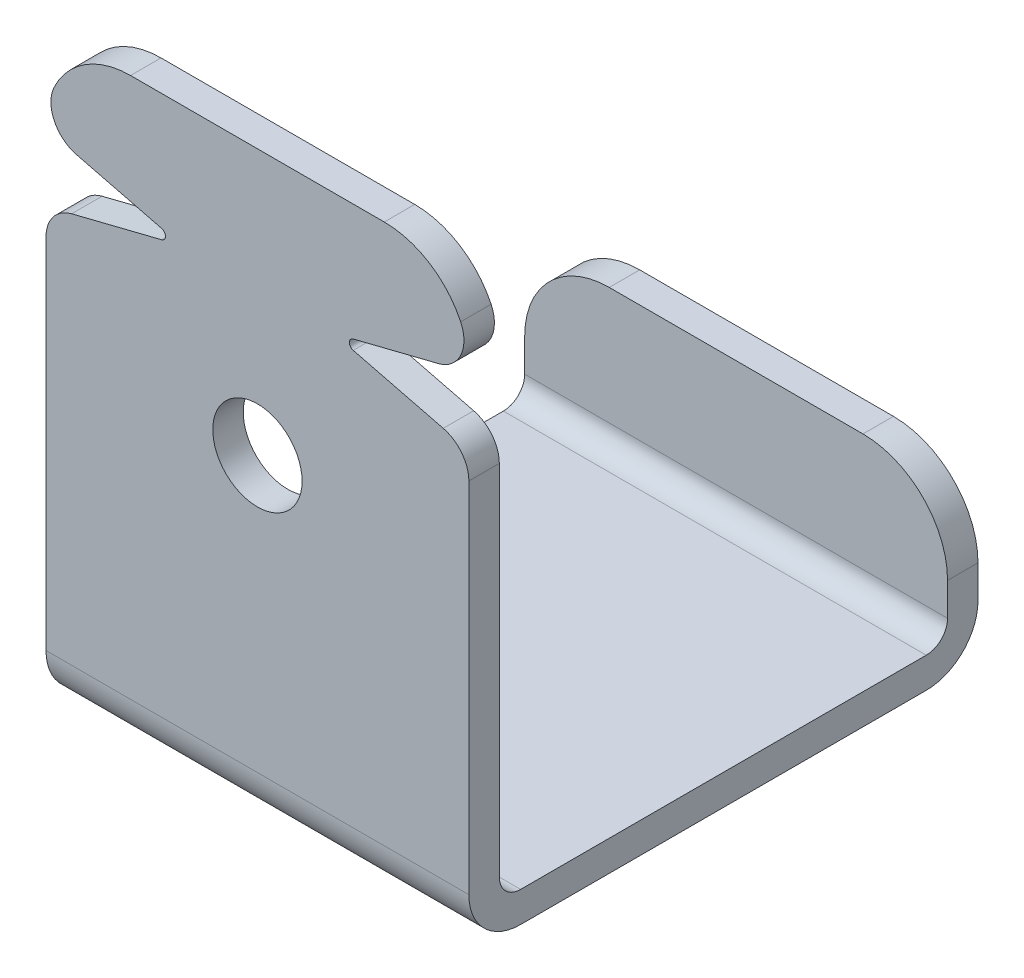
ISO-10303-21;
HEADER;
FILE_DESCRIPTION(('STEP AP214'),'2;1');
FILE_NAME('part.step','',(''),(''),'','','');
FILE_SCHEMA(('AUTOMOTIVE_DESIGN { 1 0 10303 214 1 1 1 1 }'));
ENDSEC;
DATA;
#1=APPLICATION_CONTEXT('core data for automotive mechanical design processes');
#2=APPLICATION_PROTOCOL_DEFINITION('international standard','automotive_design',2000,#1);
#3=PRODUCT_CONTEXT('',#1,'mechanical');
#4=PRODUCT('Part','Part','',(#3));
#5=PRODUCT_RELATED_PRODUCT_CATEGORY('part','',(#4));
#6=PRODUCT_DEFINITION_FORMATION('','',#4);
#7=PRODUCT_DEFINITION_CONTEXT('part definition',#1,'design');
#8=PRODUCT_DEFINITION('design','',#6,#7);
#9=PRODUCT_DEFINITION_SHAPE('','',#8);
#10=(LENGTH_UNIT() NAMED_UNIT(*) SI_UNIT(.MILLI.,.METRE.));
#11=(NAMED_UNIT(*) PLANE_ANGLE_UNIT() SI_UNIT($,.RADIAN.));
#12=(NAMED_UNIT(*) SI_UNIT($,.STERADIAN.) SOLID_ANGLE_UNIT());
#13=UNCERTAINTY_MEASURE_WITH_UNIT(LENGTH_MEASURE(1.E-05),#10,'distance_accuracy_value','');
#14=(GEOMETRIC_REPRESENTATION_CONTEXT(3) GLOBAL_UNCERTAINTY_ASSIGNED_CONTEXT((#13)) GLOBAL_UNIT_ASSIGNED_CONTEXT((#10,
#11,#12)) REPRESENTATION_CONTEXT('',''));
#15=CARTESIAN_POINT('',(0.,0.,0.));
#16=DIRECTION('',(0.,0.,1.));
#17=DIRECTION('',(1.,0.,0.));
#18=AXIS2_PLACEMENT_3D('',#15,#16,#17);
#19=CARTESIAN_POINT('',(15.875,0.,-16.8275));
#20=DIRECTION('',(0.,0.,1.));
#21=DIRECTION('',(0.,-1.,0.));
#22=AXIS2_PLACEMENT_3D('',#19,#20,#21);
#23=PLANE('',#22);
#24=DIRECTION('',(0.,1.,0.));
#25=VECTOR('',#24,1.);
#26=CARTESIAN_POINT('',(15.875,0.,-16.8275));
#27=LINE('',#26,#25);
#28=CARTESIAN_POINT('',(15.875,6.35,-16.8275));
#29=VERTEX_POINT('',#28);
#30=CARTESIAN_POINT('',(15.875,3.8862,-16.8275));
#31=VERTEX_POINT('',#30);
#32=EDGE_CURVE('E199',#29,#31,#27,.F.);
#33=ORIENTED_EDGE('',*,*,#32,.F.);
#34=CARTESIAN_POINT('',(9.525,6.35,-16.8275));
#35=DIRECTION('',(0.,0.,-1.));
#36=DIRECTION('',(0.,1.,0.));
#37=AXIS2_PLACEMENT_3D('',#34,#35,#36);
#38=CIRCLE('',#37,6.35);
#39=CARTESIAN_POINT('',(9.525,12.7,-16.8275));
#40=VERTEX_POINT('',#39);
#41=EDGE_CURVE('E20',#40,#29,#38,.T.);
#42=ORIENTED_EDGE('',*,*,#41,.F.);
#43=DIRECTION('',(1.,0.,0.));
#44=VECTOR('',#43,1.);
#45=CARTESIAN_POINT('',(15.875,12.7,-16.8275));
#46=LINE('',#45,#44);
#47=CARTESIAN_POINT('',(-9.525,12.7,-16.8275));
#48=VERTEX_POINT('',#47);
#49=EDGE_CURVE('E186',#48,#40,#46,.T.);
#50=ORIENTED_EDGE('',*,*,#49,.F.);
#51=CARTESIAN_POINT('',(-9.525,6.35,-16.8275));
#52=DIRECTION('',(0.,0.,1.));
#53=DIRECTION('',(0.,-1.,0.));
#54=AXIS2_PLACEMENT_3D('',#51,#52,#53);
#55=CIRCLE('',#54,6.35);
#56=CARTESIAN_POINT('',(-15.875,6.35,-16.8275));
#57=VERTEX_POINT('',#56);
#58=EDGE_CURVE('E310',#57,#48,#55,.F.);
#59=ORIENTED_EDGE('',*,*,#58,.F.);
#60=DIRECTION('',(0.,1.,0.));
#61=VECTOR('',#60,1.);
#62=CARTESIAN_POINT('',(-15.875,0.,-16.8275));
#63=LINE('',#62,#61);
#64=CARTESIAN_POINT('',(-15.875,3.8862,-16.8275));
#65=VERTEX_POINT('',#64);
#66=EDGE_CURVE('E331',#57,#65,#63,.F.);
#67=ORIENTED_EDGE('',*,*,#66,.T.);
#68=DIRECTION('',(-1.,0.,0.));
#69=VECTOR('',#68,1.);
#70=CARTESIAN_POINT('',(15.875,3.8862,-16.8275));
#71=LINE('',#70,#69);
#72=EDGE_CURVE('E202',#65,#31,#71,.F.);
#73=ORIENTED_EDGE('',*,*,#72,.T.);
#74=EDGE_LOOP('',(#33,#42,#50,#59,#67,#73));
#75=FACE_BOUND('',#74,.T.);
#76=ADVANCED_FACE('F17',(#75),#23,.T.);
#77=CARTESIAN_POINT('',(9.525,6.34999999999999,-19.1135));
#78=DIRECTION('',(0.,0.,-1.));
#79=DIRECTION('',(0.,1.,0.));
#80=AXIS2_PLACEMENT_3D('',#77,#78,#79);
#81=CYLINDRICAL_SURFACE('',#80,6.35);
#82=CARTESIAN_POINT('',(9.525,6.34999999999999,-19.1135));
#83=DIRECTION('',(0.,0.,-1.));
#84=DIRECTION('',(0.,1.,0.));
#85=AXIS2_PLACEMENT_3D('',#82,#83,#84);
#86=CIRCLE('',#85,6.35);
#87=CARTESIAN_POINT('',(15.875,6.34999999999999,-19.1135));
#88=VERTEX_POINT('',#87);
#89=CARTESIAN_POINT('',(9.525,12.7,-19.1135));
#90=VERTEX_POINT('',#89);
#91=EDGE_CURVE('E307',#88,#90,#86,.F.);
#92=ORIENTED_EDGE('',*,*,#91,.T.);
#93=DIRECTION('',(0.,0.,1.));
#94=VECTOR('',#93,1.);
#95=CARTESIAN_POINT('',(9.525,12.7,-19.1135));
#96=LINE('',#95,#94);
#97=EDGE_CURVE('E197',#40,#90,#96,.F.);
#98=ORIENTED_EDGE('',*,*,#97,.F.);
#99=ORIENTED_EDGE('',*,*,#41,.T.);
#100=DIRECTION('',(0.,0.,-1.));
#101=VECTOR('',#100,1.);
#102=CARTESIAN_POINT('',(15.875,6.34999999999999,-19.1135));
#103=LINE('',#102,#101);
#104=EDGE_CURVE('E195',#29,#88,#103,.T.);
#105=ORIENTED_EDGE('',*,*,#104,.T.);
#106=EDGE_LOOP('',(#92,#98,#99,#105));
#107=FACE_BOUND('',#106,.T.);
#108=ADVANCED_FACE('F193',(#107),#81,.T.);
#109=CARTESIAN_POINT('',(15.875,12.7,-19.1135));
#110=DIRECTION('',(0.,1.,0.));
#111=DIRECTION('',(0.,0.,1.));
#112=AXIS2_PLACEMENT_3D('',#109,#110,#111);
#113=PLANE('',#112);
#114=ORIENTED_EDGE('',*,*,#49,.T.);
#115=ORIENTED_EDGE('',*,*,#97,.T.);
#116=DIRECTION('',(1.,0.,0.));
#117=VECTOR('',#116,1.);
#118=CARTESIAN_POINT('',(15.875,12.7,-19.1135));
#119=LINE('',#118,#117);
#120=CARTESIAN_POINT('',(-9.525,12.7,-19.1135));
#121=VERTEX_POINT('',#120);
#122=EDGE_CURVE('E306',#90,#121,#119,.F.);
#123=ORIENTED_EDGE('',*,*,#122,.T.);
#124=DIRECTION('',(0.,0.,1.));
#125=VECTOR('',#124,1.);
#126=CARTESIAN_POINT('',(-9.525,12.7,-19.1135));
#127=LINE('',#126,#125);
#128=EDGE_CURVE('E311',#48,#121,#127,.F.);
#129=ORIENTED_EDGE('',*,*,#128,.F.);
#130=EDGE_LOOP('',(#114,#115,#123,#129));
#131=FACE_BOUND('',#130,.T.);
#132=ADVANCED_FACE('F317',(#131),#113,.T.);
#133=CARTESIAN_POINT('',(-9.525,6.34999999999999,-19.1135));
#134=DIRECTION('',(0.,0.,1.));
#135=DIRECTION('',(0.,-1.,0.));
#136=AXIS2_PLACEMENT_3D('',#133,#134,#135);
#137=CYLINDRICAL_SURFACE('',#136,6.35);
#138=CARTESIAN_POINT('',(-9.525,6.34999999999999,-19.1135));
#139=DIRECTION('',(0.,0.,1.));
#140=DIRECTION('',(0.,-1.,0.));
#141=AXIS2_PLACEMENT_3D('',#138,#139,#140);
#142=CIRCLE('',#141,6.35);
#143=CARTESIAN_POINT('',(-15.875,6.34999999999999,-19.1135));
#144=VERTEX_POINT('',#143);
#145=EDGE_CURVE('E303',#121,#144,#142,.T.);
#146=ORIENTED_EDGE('',*,*,#145,.T.);
#147=DIRECTION('',(0.,0.,-1.));
#148=VECTOR('',#147,1.);
#149=CARTESIAN_POINT('',(-15.875,6.34999999999999,-19.1135));
#150=LINE('',#149,#148);
#151=EDGE_CURVE('E314',#144,#57,#150,.F.);
#152=ORIENTED_EDGE('',*,*,#151,.T.);
#153=ORIENTED_EDGE('',*,*,#58,.T.);
#154=ORIENTED_EDGE('',*,*,#128,.T.);
#155=EDGE_LOOP('',(#146,#152,#153,#154));
#156=FACE_BOUND('',#155,.T.);
#157=ADVANCED_FACE('F333',(#156),#137,.T.);
#158=CARTESIAN_POINT('',(15.875,3.8862,-15.2273));
#159=DIRECTION('',(-1.,0.,0.));
#160=DIRECTION('',(0.,0.,1.));
#161=AXIS2_PLACEMENT_3D('',#158,#159,#160);
#162=CYLINDRICAL_SURFACE('',#161,1.6002);
#163=ORIENTED_EDGE('',*,*,#72,.F.);
#164=CARTESIAN_POINT('',(-15.875,3.8862,-15.2273));
#165=DIRECTION('',(-1.,0.,0.));
#166=DIRECTION('',(0.,0.,1.));
#167=AXIS2_PLACEMENT_3D('',#164,#165,#166);
#168=CIRCLE('',#167,1.6002);
#169=CARTESIAN_POINT('',(-15.875,2.286,-15.2273));
#170=VERTEX_POINT('',#169);
#171=EDGE_CURVE('E298',#65,#170,#168,.T.);
#172=ORIENTED_EDGE('',*,*,#171,.T.);
#173=DIRECTION('',(1.,0.,0.));
#174=VECTOR('',#173,1.);
#175=CARTESIAN_POINT('',(15.875,2.286,-15.2273));
#176=LINE('',#175,#174);
#177=CARTESIAN_POINT('',(15.875,2.286,-15.2273));
#178=VERTEX_POINT('',#177);
#179=EDGE_CURVE('E301',#178,#170,#176,.F.);
#180=ORIENTED_EDGE('',*,*,#179,.F.);
#181=CARTESIAN_POINT('',(15.875,3.8862,-15.2273));
#182=DIRECTION('',(-1.,0.,0.));
#183=DIRECTION('',(0.,0.,1.));
#184=AXIS2_PLACEMENT_3D('',#181,#182,#183);
#185=CIRCLE('',#184,1.6002);
#186=EDGE_CURVE('E309',#178,#31,#185,.F.);
#187=ORIENTED_EDGE('',*,*,#186,.T.);
#188=EDGE_LOOP('',(#163,#172,#180,#187));
#189=FACE_BOUND('',#188,.T.);
#190=ADVANCED_FACE('F371',(#189),#162,.F.);
#191=CARTESIAN_POINT('',(15.875,0.,-19.1135));
#192=DIRECTION('',(0.,0.,1.));
#193=DIRECTION('',(0.,-1.,0.));
#194=AXIS2_PLACEMENT_3D('',#191,#192,#193);
#195=PLANE('',#194);
#196=ORIENTED_EDGE('',*,*,#145,.F.);
#197=ORIENTED_EDGE('',*,*,#122,.F.);
#198=ORIENTED_EDGE('',*,*,#91,.F.);
#199=DIRECTION('',(0.,-1.,0.));
#200=VECTOR('',#199,1.);
#201=CARTESIAN_POINT('',(15.875,0.,-19.1135));
#202=LINE('',#201,#200);
#203=CARTESIAN_POINT('',(15.875,3.8862,-19.1135));
#204=VERTEX_POINT('',#203);
#205=EDGE_CURVE('E210',#204,#88,#202,.F.);
#206=ORIENTED_EDGE('',*,*,#205,.F.);
#207=DIRECTION('',(-1.,0.,0.));
#208=VECTOR('',#207,1.);
#209=CARTESIAN_POINT('',(15.875,3.8862,-19.1135));
#210=LINE('',#209,#208);
#211=CARTESIAN_POINT('',(-15.875,3.8862,-19.1135));
#212=VERTEX_POINT('',#211);
#213=EDGE_CURVE('E294',#212,#204,#210,.F.);
#214=ORIENTED_EDGE('',*,*,#213,.F.);
#215=DIRECTION('',(0.,-1.,0.));
#216=VECTOR('',#215,1.);
#217=CARTESIAN_POINT('',(-15.875,0.,-19.1135));
#218=LINE('',#217,#216);
#219=EDGE_CURVE('E302',#144,#212,#218,.T.);
#220=ORIENTED_EDGE('',*,*,#219,.F.);
#221=EDGE_LOOP('',(#196,#197,#198,#206,#214,#220));
#222=FACE_BOUND('',#221,.T.);
#223=ADVANCED_FACE('F320',(#222),#195,.F.);
#224=CARTESIAN_POINT('',(15.875,2.286,19.1135));
#225=DIRECTION('',(0.,1.,0.));
#226=DIRECTION('',(0.,0.,1.));
#227=AXIS2_PLACEMENT_3D('',#224,#225,#226);
#228=PLANE('',#227);
#229=DIRECTION('',(0.,0.,-1.));
#230=VECTOR('',#229,1.);
#231=CARTESIAN_POINT('',(15.875,2.286,19.1135));
#232=LINE('',#231,#230);
#233=CARTESIAN_POINT('',(15.875,2.286,15.2273));
#234=VERTEX_POINT('',#233);
#235=EDGE_CURVE('E297',#178,#234,#232,.F.);
#236=ORIENTED_EDGE('',*,*,#235,.F.);
#237=ORIENTED_EDGE('',*,*,#179,.T.);
#238=DIRECTION('',(0.,0.,-1.));
#239=VECTOR('',#238,1.);
#240=CARTESIAN_POINT('',(-15.875,2.286,19.1135));
#241=LINE('',#240,#239);
#242=CARTESIAN_POINT('',(-15.875,2.286,15.2273));
#243=VERTEX_POINT('',#242);
#244=EDGE_CURVE('E329',#170,#243,#241,.F.);
#245=ORIENTED_EDGE('',*,*,#244,.T.);
#246=DIRECTION('',(-1.,0.,0.));
#247=VECTOR('',#246,1.);
#248=CARTESIAN_POINT('',(15.875,2.286,15.2273));
#249=LINE('',#248,#247);
#250=EDGE_CURVE('E291',#243,#234,#249,.F.);
#251=ORIENTED_EDGE('',*,*,#250,.T.);
#252=EDGE_LOOP('',(#236,#237,#245,#251));
#253=FACE_BOUND('',#252,.T.);
#254=ADVANCED_FACE('F367',(#253),#228,.T.);
#255=CARTESIAN_POINT('',(15.875,3.8862,-15.2273));
#256=DIRECTION('',(-1.,0.,0.));
#257=DIRECTION('',(0.,0.,1.));
#258=AXIS2_PLACEMENT_3D('',#255,#256,#257);
#259=CYLINDRICAL_SURFACE('',#258,3.8862);
#260=CARTESIAN_POINT('',(-15.875,3.8862,-15.2273));
#261=DIRECTION('',(-1.,0.,0.));
#262=DIRECTION('',(0.,0.,1.));
#263=AXIS2_PLACEMENT_3D('',#260,#261,#262);
#264=CIRCLE('',#263,3.8862);
#265=CARTESIAN_POINT('',(-15.875,0.,-15.2273));
#266=VERTEX_POINT('',#265);
#267=EDGE_CURVE('E292',#266,#212,#264,.F.);
#268=ORIENTED_EDGE('',*,*,#267,.T.);
#269=ORIENTED_EDGE('',*,*,#213,.T.);
#270=CARTESIAN_POINT('',(15.875,3.8862,-15.2273));
#271=DIRECTION('',(-1.,0.,0.));
#272=DIRECTION('',(0.,0.,1.));
#273=AXIS2_PLACEMENT_3D('',#270,#271,#272);
#274=CIRCLE('',#273,3.8862);
#275=CARTESIAN_POINT('',(15.875,0.,-15.2273));
#276=VERTEX_POINT('',#275);
#277=EDGE_CURVE('E295',#204,#276,#274,.T.);
#278=ORIENTED_EDGE('',*,*,#277,.T.);
#279=DIRECTION('',(1.,0.,0.));
#280=VECTOR('',#279,1.);
#281=CARTESIAN_POINT('',(15.875,0.,-15.2273));
#282=LINE('',#281,#280);
#283=EDGE_CURVE('E350',#276,#266,#282,.F.);
#284=ORIENTED_EDGE('',*,*,#283,.T.);
#285=EDGE_LOOP('',(#268,#269,#278,#284));
#286=FACE_BOUND('',#285,.T.);
#287=ADVANCED_FACE('F342',(#286),#259,.T.);
#288=CARTESIAN_POINT('',(15.875,3.8862,15.2273));
#289=DIRECTION('',(-1.,0.,0.));
#290=DIRECTION('',(0.,0.,1.));
#291=AXIS2_PLACEMENT_3D('',#288,#289,#290);
#292=CYLINDRICAL_SURFACE('',#291,1.6002);
#293=ORIENTED_EDGE('',*,*,#250,.F.);
#294=CARTESIAN_POINT('',(-15.875,3.8862,15.2273));
#295=DIRECTION('',(-1.,0.,0.));
#296=DIRECTION('',(0.,0.,1.));
#297=AXIS2_PLACEMENT_3D('',#294,#295,#296);
#298=CIRCLE('',#297,1.6002);
#299=CARTESIAN_POINT('',(-15.875,3.8862,16.8275));
#300=VERTEX_POINT('',#299);
#301=EDGE_CURVE('E283',#243,#300,#298,.T.);
#302=ORIENTED_EDGE('',*,*,#301,.T.);
#303=DIRECTION('',(1.,0.,0.));
#304=VECTOR('',#303,1.);
#305=CARTESIAN_POINT('',(15.875,3.8862,16.8275));
#306=LINE('',#305,#304);
#307=CARTESIAN_POINT('',(15.875,3.8862,16.8275));
#308=VERTEX_POINT('',#307);
#309=EDGE_CURVE('E276',#308,#300,#306,.F.);
#310=ORIENTED_EDGE('',*,*,#309,.F.);
#311=CARTESIAN_POINT('',(15.875,3.8862,15.2273));
#312=DIRECTION('',(-1.,0.,0.));
#313=DIRECTION('',(0.,0.,1.));
#314=AXIS2_PLACEMENT_3D('',#311,#312,#313);
#315=CIRCLE('',#314,1.6002);
#316=EDGE_CURVE('E287',#308,#234,#315,.F.);
#317=ORIENTED_EDGE('',*,*,#316,.T.);
#318=EDGE_LOOP('',(#293,#302,#310,#317));
#319=FACE_BOUND('',#318,.T.);
#320=ADVANCED_FACE('F376',(#319),#292,.F.);
#321=CARTESIAN_POINT('',(15.875,0.,19.1135));
#322=DIRECTION('',(0.,1.,0.));
#323=DIRECTION('',(0.,0.,1.));
#324=AXIS2_PLACEMENT_3D('',#321,#322,#323);
#325=PLANE('',#324);
#326=ORIENTED_EDGE('',*,*,#283,.F.);
#327=DIRECTION('',(0.,0.,1.));
#328=VECTOR('',#327,1.);
#329=CARTESIAN_POINT('',(15.875,0.,19.1135));
#330=LINE('',#329,#328);
#331=CARTESIAN_POINT('',(15.875,0.,15.2273));
#332=VERTEX_POINT('',#331);
#333=EDGE_CURVE('E290',#332,#276,#330,.F.);
#334=ORIENTED_EDGE('',*,*,#333,.F.);
#335=DIRECTION('',(-1.,0.,0.));
#336=VECTOR('',#335,1.);
#337=CARTESIAN_POINT('',(15.875,0.,15.2273));
#338=LINE('',#337,#336);
#339=CARTESIAN_POINT('',(-15.875,0.,15.2273));
#340=VERTEX_POINT('',#339);
#341=EDGE_CURVE('E262',#340,#332,#338,.F.);
#342=ORIENTED_EDGE('',*,*,#341,.F.);
#343=DIRECTION('',(0.,0.,1.));
#344=VECTOR('',#343,1.);
#345=CARTESIAN_POINT('',(-15.875,0.,19.1135));
#346=LINE('',#345,#344);
#347=EDGE_CURVE('E286',#266,#340,#346,.T.);
#348=ORIENTED_EDGE('',*,*,#347,.F.);
#349=EDGE_LOOP('',(#326,#334,#342,#348));
#350=FACE_BOUND('',#349,.T.);
#351=ADVANCED_FACE('F415',(#350),#325,.F.);
#352=CARTESIAN_POINT('',(-7.28590324336034,35.306,16.8275));
#353=DIRECTION('',(0.,0.,-1.));
#354=DIRECTION('',(0.,1.,0.));
#355=AXIS2_PLACEMENT_3D('',#352,#353,#354);
#356=CYLINDRICAL_SURFACE('',#355,0.380999999999999);
#357=DIRECTION('',(0.,0.,1.));
#358=VECTOR('',#357,1.);
#359=CARTESIAN_POINT('',(-7.1934971702215,34.9363757074446,16.8275));
#360=LINE('',#359,#358);
#361=CARTESIAN_POINT('',(-7.1934971702215,34.9363757074446,19.1135));
#362=VERTEX_POINT('',#361);
#363=CARTESIAN_POINT('',(-7.1934971702215,34.9363757074446,16.8275));
#364=VERTEX_POINT('',#363);
#365=EDGE_CURVE('E409',#362,#364,#360,.F.);
#366=ORIENTED_EDGE('',*,*,#365,.F.);
#367=CARTESIAN_POINT('',(-7.28590324336034,35.306,19.1135));
#368=DIRECTION('',(0.,0.,-1.));
#369=DIRECTION('',(0.,1.,0.));
#370=AXIS2_PLACEMENT_3D('',#367,#368,#369);
#371=CIRCLE('',#370,0.380999999999999);
#372=CARTESIAN_POINT('',(-7.1934971702215,35.6756242925554,19.1135));
#373=VERTEX_POINT('',#372);
#374=EDGE_CURVE('E281',#373,#362,#371,.T.);
#375=ORIENTED_EDGE('',*,*,#374,.F.);
#376=DIRECTION('',(0.,0.,1.));
#377=VECTOR('',#376,1.);
#378=CARTESIAN_POINT('',(-7.1934971702215,35.6756242925554,16.8275));
#379=LINE('',#378,#377);
#380=CARTESIAN_POINT('',(-7.1934971702215,35.6756242925554,16.8275));
#381=VERTEX_POINT('',#380);
#382=EDGE_CURVE('E255',#381,#373,#379,.T.);
#383=ORIENTED_EDGE('',*,*,#382,.F.);
#384=CARTESIAN_POINT('',(-7.28590324336034,35.306,16.8275));
#385=DIRECTION('',(0.,0.,-1.));
#386=DIRECTION('',(0.,1.,0.));
#387=AXIS2_PLACEMENT_3D('',#384,#385,#386);
#388=CIRCLE('',#387,0.380999999999999);
#389=EDGE_CURVE('E274',#364,#381,#388,.F.);
#390=ORIENTED_EDGE('',*,*,#389,.F.);
#391=EDGE_LOOP('',(#366,#375,#383,#390));
#392=FACE_BOUND('',#391,.T.);
#393=ADVANCED_FACE('F476',(#392),#356,.F.);
#394=CARTESIAN_POINT('',(7.28590324336034,35.306,16.8275));
#395=DIRECTION('',(0.,0.,-1.));
#396=DIRECTION('',(0.,1.,0.));
#397=AXIS2_PLACEMENT_3D('',#394,#395,#396);
#398=CYLINDRICAL_SURFACE('',#397,0.380999999999999);
#399=DIRECTION('',(0.,0.,1.));
#400=VECTOR('',#399,1.);
#401=CARTESIAN_POINT('',(7.1934971702215,35.6756242925554,16.8275));
#402=LINE('',#401,#400);
#403=CARTESIAN_POINT('',(7.1934971702215,35.6756242925554,19.1135));
#404=VERTEX_POINT('',#403);
#405=CARTESIAN_POINT('',(7.1934971702215,35.6756242925554,16.8275));
#406=VERTEX_POINT('',#405);
#407=EDGE_CURVE('E399',#404,#406,#402,.F.);
#408=ORIENTED_EDGE('',*,*,#407,.F.);
#409=CARTESIAN_POINT('',(7.28590324336034,35.306,19.1135));
#410=DIRECTION('',(0.,0.,-1.));
#411=DIRECTION('',(0.,1.,0.));
#412=AXIS2_PLACEMENT_3D('',#409,#410,#411);
#413=CIRCLE('',#412,0.380999999999999);
#414=CARTESIAN_POINT('',(7.1934971702215,34.9363757074446,19.1135));
#415=VERTEX_POINT('',#414);
#416=EDGE_CURVE('E279',#415,#404,#413,.T.);
#417=ORIENTED_EDGE('',*,*,#416,.F.);
#418=DIRECTION('',(0.,0.,1.));
#419=VECTOR('',#418,1.);
#420=CARTESIAN_POINT('',(7.1934971702215,34.9363757074446,16.8275));
#421=LINE('',#420,#419);
#422=CARTESIAN_POINT('',(7.1934971702215,34.9363757074446,16.8275));
#423=VERTEX_POINT('',#422);
#424=EDGE_CURVE('E269',#423,#415,#421,.T.);
#425=ORIENTED_EDGE('',*,*,#424,.F.);
#426=CARTESIAN_POINT('',(7.28590324336034,35.306,16.8275));
#427=DIRECTION('',(0.,0.,-1.));
#428=DIRECTION('',(0.,1.,0.));
#429=AXIS2_PLACEMENT_3D('',#426,#427,#428);
#430=CIRCLE('',#429,0.380999999999999);
#431=EDGE_CURVE('E277',#406,#423,#430,.F.);
#432=ORIENTED_EDGE('',*,*,#431,.F.);
#433=EDGE_LOOP('',(#408,#417,#425,#432));
#434=FACE_BOUND('',#433,.T.);
#435=ADVANCED_FACE('F493',(#434),#398,.F.);
#436=CARTESIAN_POINT('',(15.875,44.45,16.8275));
#437=DIRECTION('',(0.,0.,-1.));
#438=DIRECTION('',(0.,1.,0.));
#439=AXIS2_PLACEMENT_3D('',#436,#437,#438);
#440=PLANE('',#439);
#441=CARTESIAN_POINT('',(-9.525,38.1,16.8275));
#442=DIRECTION('',(0.,0.,1.));
#443=DIRECTION('',(0.,-1.,0.));
#444=AXIS2_PLACEMENT_3D('',#441,#442,#443);
#445=CIRCLE('',#444,6.35);
#446=CARTESIAN_POINT('',(-9.525,44.45,16.8275));
#447=VERTEX_POINT('',#446);
#448=CARTESIAN_POINT('',(-15.2591569460332,40.827992690287,16.8275));
#449=VERTEX_POINT('',#448);
#450=EDGE_CURVE('E249',#447,#449,#445,.T.);
#451=ORIENTED_EDGE('',*,*,#450,.F.);
#452=DIRECTION('',(1.,0.,0.));
#453=VECTOR('',#452,1.);
#454=CARTESIAN_POINT('',(15.875,44.45,16.8275));
#455=LINE('',#454,#453);
#456=CARTESIAN_POINT('',(9.525,44.45,16.8275));
#457=VERTEX_POINT('',#456);
#458=EDGE_CURVE('E248',#447,#457,#455,.T.);
#459=ORIENTED_EDGE('',*,*,#458,.T.);
#460=CARTESIAN_POINT('',(9.525,38.1,16.8275));
#461=DIRECTION('',(0.,0.,-1.));
#462=DIRECTION('',(0.,1.,0.));
#463=AXIS2_PLACEMENT_3D('',#460,#461,#462);
#464=CIRCLE('',#463,6.35);
#465=CARTESIAN_POINT('',(15.2591569460332,40.827992690287,16.8275));
#466=VERTEX_POINT('',#465);
#467=EDGE_CURVE('E246',#466,#457,#464,.F.);
#468=ORIENTED_EDGE('',*,*,#467,.F.);
#469=CARTESIAN_POINT('',(12.9654941676199,39.7367956141722,16.8275));
#470=DIRECTION('',(0.,0.,-1.));
#471=DIRECTION('',(0.,1.,0.));
#472=AXIS2_PLACEMENT_3D('',#469,#470,#471);
#473=CIRCLE('',#472,2.54);
#474=CARTESIAN_POINT('',(13.5815346552122,37.272633663803,16.8275));
#475=VERTEX_POINT('',#474);
#476=EDGE_CURVE('E242',#475,#466,#473,.F.);
#477=ORIENTED_EDGE('',*,*,#476,.F.);
#478=DIRECTION('',(0.970142500145332,0.242535625036333,0.));
#479=VECTOR('',#478,1.);
#480=CARTESIAN_POINT('',(5.715,35.306,16.8275));
#481=LINE('',#480,#479);
#482=EDGE_CURVE('E397',#406,#475,#481,.T.);
#483=ORIENTED_EDGE('',*,*,#482,.F.);
#484=ORIENTED_EDGE('',*,*,#431,.T.);
#485=DIRECTION('',(-0.970142500145332,0.242535625036332,0.));
#486=VECTOR('',#485,1.);
#487=CARTESIAN_POINT('',(15.875,32.766,16.8275));
#488=LINE('',#487,#486);
#489=CARTESIAN_POINT('',(13.9510404875923,33.2469898781019,16.8275));
#490=VERTEX_POINT('',#489);
#491=EDGE_CURVE('E273',#490,#423,#488,.T.);
#492=ORIENTED_EDGE('',*,*,#491,.F.);
#493=CARTESIAN_POINT('',(13.335,30.7828279277328,16.8275));
#494=DIRECTION('',(0.,0.,1.));
#495=DIRECTION('',(0.,-1.,0.));
#496=AXIS2_PLACEMENT_3D('',#493,#494,#495);
#497=CIRCLE('',#496,2.54);
#498=CARTESIAN_POINT('',(15.875,30.7828279277328,16.8275));
#499=VERTEX_POINT('',#498);
#500=EDGE_CURVE('E266',#499,#490,#497,.T.);
#501=ORIENTED_EDGE('',*,*,#500,.F.);
#502=DIRECTION('',(0.,1.,0.));
#503=VECTOR('',#502,1.);
#504=CARTESIAN_POINT('',(15.875,44.45,16.8275));
#505=LINE('',#504,#503);
#506=EDGE_CURVE('E356',#308,#499,#505,.T.);
#507=ORIENTED_EDGE('',*,*,#506,.F.);
#508=ORIENTED_EDGE('',*,*,#309,.T.);
#509=DIRECTION('',(0.,1.,0.));
#510=VECTOR('',#509,1.);
#511=CARTESIAN_POINT('',(-15.875,44.45,16.8275));
#512=LINE('',#511,#510);
#513=CARTESIAN_POINT('',(-15.875,30.7828279277328,16.8275));
#514=VERTEX_POINT('',#513);
#515=EDGE_CURVE('E259',#300,#514,#512,.T.);
#516=ORIENTED_EDGE('',*,*,#515,.T.);
#517=CARTESIAN_POINT('',(-13.335,30.7828279277328,16.8275));
#518=DIRECTION('',(0.,0.,-1.));
#519=DIRECTION('',(0.,1.,0.));
#520=AXIS2_PLACEMENT_3D('',#517,#518,#519);
#521=CIRCLE('',#520,2.54);
#522=CARTESIAN_POINT('',(-13.9510404875923,33.2469898781019,16.8275));
#523=VERTEX_POINT('',#522);
#524=EDGE_CURVE('E256',#523,#514,#521,.F.);
#525=ORIENTED_EDGE('',*,*,#524,.F.);
#526=DIRECTION('',(-0.970142500145332,-0.242535625036333,0.));
#527=VECTOR('',#526,1.);
#528=CARTESIAN_POINT('',(-5.715,35.306,16.8275));
#529=LINE('',#528,#527);
#530=EDGE_CURVE('E407',#364,#523,#529,.T.);
#531=ORIENTED_EDGE('',*,*,#530,.F.);
#532=ORIENTED_EDGE('',*,*,#389,.T.);
#533=DIRECTION('',(0.970142500145332,-0.242535625036333,0.));
#534=VECTOR('',#533,1.);
#535=CARTESIAN_POINT('',(-15.875,37.846,16.8275));
#536=LINE('',#535,#534);
#537=CARTESIAN_POINT('',(-13.5815346552122,37.272633663803,16.8275));
#538=VERTEX_POINT('',#537);
#539=EDGE_CURVE('E403',#538,#381,#536,.T.);
#540=ORIENTED_EDGE('',*,*,#539,.F.);
#541=CARTESIAN_POINT('',(-12.9654941676199,39.7367956141722,16.8275));
#542=DIRECTION('',(0.,0.,1.));
#543=DIRECTION('',(0.,-1.,0.));
#544=AXIS2_PLACEMENT_3D('',#541,#542,#543);
#545=CIRCLE('',#544,2.54);
#546=EDGE_CURVE('E253',#449,#538,#545,.T.);
#547=ORIENTED_EDGE('',*,*,#546,.F.);
#548=EDGE_LOOP('',(#451,#459,#468,#477,#483,#484,#492,#501,#507,#508,#516,#525,#531,#532,#540,#547));
#549=FACE_BOUND('',#548,.T.);
#550=CARTESIAN_POINT('',(0.,24.511,16.8275));
#551=DIRECTION('',(0.,0.,1.));
#552=DIRECTION('',(1.,0.,0.));
#553=AXIS2_PLACEMENT_3D('',#550,#551,#552);
#554=CIRCLE('',#553,3.3528);
#555=CARTESIAN_POINT('',(3.3528,24.511,16.8275));
#556=VERTEX_POINT('',#555);
#557=EDGE_CURVE('E270',#556,#556,#554,.T.);
#558=ORIENTED_EDGE('',*,*,#557,.T.);
#559=EDGE_LOOP('',(#558));
#560=FACE_BOUND('',#559,.T.);
#561=ADVANCED_FACE('F383',(#549,#560),#440,.T.);
#562=CARTESIAN_POINT('',(0.,24.511,-19.1145));
#563=DIRECTION('',(0.,0.,1.));
#564=DIRECTION('',(1.,0.,0.));
#565=AXIS2_PLACEMENT_3D('',#562,#563,#564);
#566=CYLINDRICAL_SURFACE('',#565,3.3528);
#567=ORIENTED_EDGE('',*,*,#557,.F.);
#568=EDGE_LOOP('',(#567));
#569=FACE_BOUND('',#568,.T.);
#570=CARTESIAN_POINT('',(0.,24.511,19.1135));
#571=DIRECTION('',(0.,0.,1.));
#572=DIRECTION('',(1.,0.,0.));
#573=AXIS2_PLACEMENT_3D('',#570,#571,#572);
#574=CIRCLE('',#573,3.3528);
#575=CARTESIAN_POINT('',(3.3528,24.511,19.1135));
#576=VERTEX_POINT('',#575);
#577=EDGE_CURVE('E239',#576,#576,#574,.T.);
#578=ORIENTED_EDGE('',*,*,#577,.T.);
#579=EDGE_LOOP('',(#578));
#580=FACE_BOUND('',#579,.T.);
#581=ADVANCED_FACE('F497',(#569,#580),#566,.F.);
#582=CARTESIAN_POINT('',(15.875,32.766,16.8275));
#583=DIRECTION('',(0.242535625036332,0.970142500145332,0.));
#584=DIRECTION('',(-0.970142500145332,0.242535625036332,0.));
#585=AXIS2_PLACEMENT_3D('',#582,#583,#584);
#586=PLANE('',#585);
#587=DIRECTION('',(0.970142500145332,-0.242535625036333,0.));
#588=VECTOR('',#587,1.);
#589=CARTESIAN_POINT('',(7.1934971702215,34.9363757074446,19.1135));
#590=LINE('',#589,#588);
#591=CARTESIAN_POINT('',(13.9510404875923,33.2469898781019,19.1135));
#592=VERTEX_POINT('',#591);
#593=EDGE_CURVE('E238',#415,#592,#590,.T.);
#594=ORIENTED_EDGE('',*,*,#593,.T.);
#595=DIRECTION('',(0.,0.,1.));
#596=VECTOR('',#595,1.);
#597=CARTESIAN_POINT('',(13.9510404875923,33.2469898781019,19.1135));
#598=LINE('',#597,#596);
#599=EDGE_CURVE('E268',#490,#592,#598,.T.);
#600=ORIENTED_EDGE('',*,*,#599,.F.);
#601=ORIENTED_EDGE('',*,*,#491,.T.);
#602=ORIENTED_EDGE('',*,*,#424,.T.);
#603=EDGE_LOOP('',(#594,#600,#601,#602));
#604=FACE_BOUND('',#603,.T.);
#605=ADVANCED_FACE('F495',(#604),#586,.T.);
#606=CARTESIAN_POINT('',(13.335,30.7828279277328,19.1135));
#607=DIRECTION('',(0.,0.,1.));
#608=DIRECTION('',(0.,-1.,0.));
#609=AXIS2_PLACEMENT_3D('',#606,#607,#608);
#610=CYLINDRICAL_SURFACE('',#609,2.54);
#611=CARTESIAN_POINT('',(13.335,30.7828279277328,19.1135));
#612=DIRECTION('',(0.,0.,1.));
#613=DIRECTION('',(0.,-1.,0.));
#614=AXIS2_PLACEMENT_3D('',#611,#612,#613);
#615=CIRCLE('',#614,2.54);
#616=CARTESIAN_POINT('',(15.875,30.7828279277328,19.1135));
#617=VERTEX_POINT('',#616);
#618=EDGE_CURVE('E234',#592,#617,#615,.F.);
#619=ORIENTED_EDGE('',*,*,#618,.T.);
#620=DIRECTION('',(0.,0.,-1.));
#621=VECTOR('',#620,1.);
#622=CARTESIAN_POINT('',(15.875,30.7828279277328,19.1135));
#623=LINE('',#622,#621);
#624=EDGE_CURVE('E265',#499,#617,#623,.F.);
#625=ORIENTED_EDGE('',*,*,#624,.F.);
#626=ORIENTED_EDGE('',*,*,#500,.T.);
#627=ORIENTED_EDGE('',*,*,#599,.T.);
#628=EDGE_LOOP('',(#619,#625,#626,#627));
#629=FACE_BOUND('',#628,.T.);
#630=ADVANCED_FACE('F387',(#629),#610,.T.);
#631=CARTESIAN_POINT('',(15.875,44.45,19.1135));
#632=DIRECTION('',(1.,0.,0.));
#633=DIRECTION('',(0.,0.,-1.));
#634=AXIS2_PLACEMENT_3D('',#631,#632,#633);
#635=PLANE('',#634);
#636=DIRECTION('',(0.,1.,0.));
#637=VECTOR('',#636,1.);
#638=CARTESIAN_POINT('',(15.875,44.45,19.1135));
#639=LINE('',#638,#637);
#640=CARTESIAN_POINT('',(15.875,3.8862,19.1135));
#641=VERTEX_POINT('',#640);
#642=EDGE_CURVE('E237',#617,#641,#639,.F.);
#643=ORIENTED_EDGE('',*,*,#642,.T.);
#644=CARTESIAN_POINT('',(15.875,3.8862,15.2273));
#645=DIRECTION('',(-1.,0.,0.));
#646=DIRECTION('',(0.,0.,1.));
#647=AXIS2_PLACEMENT_3D('',#644,#645,#646);
#648=CIRCLE('',#647,3.8862);
#649=EDGE_CURVE('E263',#332,#641,#648,.T.);
#650=ORIENTED_EDGE('',*,*,#649,.F.);
#651=ORIENTED_EDGE('',*,*,#333,.T.);
#652=ORIENTED_EDGE('',*,*,#277,.F.);
#653=ORIENTED_EDGE('',*,*,#205,.T.);
#654=ORIENTED_EDGE('',*,*,#104,.F.);
#655=ORIENTED_EDGE('',*,*,#32,.T.);
#656=ORIENTED_EDGE('',*,*,#186,.F.);
#657=ORIENTED_EDGE('',*,*,#235,.T.);
#658=ORIENTED_EDGE('',*,*,#316,.F.);
#659=ORIENTED_EDGE('',*,*,#506,.T.);
#660=ORIENTED_EDGE('',*,*,#624,.T.);
#661=EDGE_LOOP('',(#643,#650,#651,#652,#653,#654,#655,#656,#657,#658,#659,#660));
#662=FACE_BOUND('',#661,.T.);
#663=ADVANCED_FACE('F208',(#662),#635,.T.);
#664=CARTESIAN_POINT('',(15.875,3.8862,15.2273));
#665=DIRECTION('',(-1.,0.,0.));
#666=DIRECTION('',(0.,0.,1.));
#667=AXIS2_PLACEMENT_3D('',#664,#665,#666);
#668=CYLINDRICAL_SURFACE('',#667,3.8862);
#669=CARTESIAN_POINT('',(-15.875,3.8862,15.2273));
#670=DIRECTION('',(-1.,0.,0.));
#671=DIRECTION('',(0.,0.,1.));
#672=AXIS2_PLACEMENT_3D('',#669,#670,#671);
#673=CIRCLE('',#672,3.8862);
#674=CARTESIAN_POINT('',(-15.875,3.8862,19.1135));
#675=VERTEX_POINT('',#674);
#676=EDGE_CURVE('E260',#675,#340,#673,.F.);
#677=ORIENTED_EDGE('',*,*,#676,.T.);
#678=ORIENTED_EDGE('',*,*,#341,.T.);
#679=ORIENTED_EDGE('',*,*,#649,.T.);
#680=DIRECTION('',(1.,0.,0.));
#681=VECTOR('',#680,1.);
#682=CARTESIAN_POINT('',(15.875,3.8862,19.1135));
#683=LINE('',#682,#681);
#684=EDGE_CURVE('E392',#641,#675,#683,.F.);
#685=ORIENTED_EDGE('',*,*,#684,.T.);
#686=EDGE_LOOP('',(#677,#678,#679,#685));
#687=FACE_BOUND('',#686,.T.);
#688=ADVANCED_FACE('F417',(#687),#668,.T.);
#689=CARTESIAN_POINT('',(-15.875,44.45,19.1135));
#690=DIRECTION('',(1.,0.,0.));
#691=DIRECTION('',(0.,0.,-1.));
#692=AXIS2_PLACEMENT_3D('',#689,#690,#691);
#693=PLANE('',#692);
#694=DIRECTION('',(0.,0.,-1.));
#695=VECTOR('',#694,1.);
#696=CARTESIAN_POINT('',(-15.875,30.7828279277328,16.8275));
#697=LINE('',#696,#695);
#698=CARTESIAN_POINT('',(-15.875,30.7828279277328,19.1135));
#699=VERTEX_POINT('',#698);
#700=EDGE_CURVE('E258',#514,#699,#697,.F.);
#701=ORIENTED_EDGE('',*,*,#700,.F.);
#702=ORIENTED_EDGE('',*,*,#515,.F.);
#703=ORIENTED_EDGE('',*,*,#301,.F.);
#704=ORIENTED_EDGE('',*,*,#244,.F.);
#705=ORIENTED_EDGE('',*,*,#171,.F.);
#706=ORIENTED_EDGE('',*,*,#66,.F.);
#707=ORIENTED_EDGE('',*,*,#151,.F.);
#708=ORIENTED_EDGE('',*,*,#219,.T.);
#709=ORIENTED_EDGE('',*,*,#267,.F.);
#710=ORIENTED_EDGE('',*,*,#347,.T.);
#711=ORIENTED_EDGE('',*,*,#676,.F.);
#712=DIRECTION('',(0.,1.,0.));
#713=VECTOR('',#712,1.);
#714=CARTESIAN_POINT('',(-15.875,44.45,19.1135));
#715=LINE('',#714,#713);
#716=EDGE_CURVE('E233',#675,#699,#715,.T.);
#717=ORIENTED_EDGE('',*,*,#716,.T.);
#718=EDGE_LOOP('',(#701,#702,#703,#704,#705,#706,#707,#708,#709,#710,#711,#717));
#719=FACE_BOUND('',#718,.T.);
#720=ADVANCED_FACE('F338',(#719),#693,.F.);
#721=CARTESIAN_POINT('',(-13.335,30.7828279277328,16.8275));
#722=DIRECTION('',(0.,0.,-1.));
#723=DIRECTION('',(0.,1.,0.));
#724=AXIS2_PLACEMENT_3D('',#721,#722,#723);
#725=CYLINDRICAL_SURFACE('',#724,2.54);
#726=CARTESIAN_POINT('',(-13.335,30.7828279277328,19.1135));
#727=DIRECTION('',(0.,0.,-1.));
#728=DIRECTION('',(0.,1.,0.));
#729=AXIS2_PLACEMENT_3D('',#726,#727,#728);
#730=CIRCLE('',#729,2.54);
#731=CARTESIAN_POINT('',(-13.9510404875923,33.2469898781019,19.1135));
#732=VERTEX_POINT('',#731);
#733=EDGE_CURVE('E229',#699,#732,#730,.T.);
#734=ORIENTED_EDGE('',*,*,#733,.T.);
#735=DIRECTION('',(0.,0.,1.));
#736=VECTOR('',#735,1.);
#737=CARTESIAN_POINT('',(-13.9510404875923,33.2469898781019,16.8275));
#738=LINE('',#737,#736);
#739=EDGE_CURVE('E406',#523,#732,#738,.T.);
#740=ORIENTED_EDGE('',*,*,#739,.F.);
#741=ORIENTED_EDGE('',*,*,#524,.T.);
#742=ORIENTED_EDGE('',*,*,#700,.T.);
#743=EDGE_LOOP('',(#734,#740,#741,#742));
#744=FACE_BOUND('',#743,.T.);
#745=ADVANCED_FACE('F440',(#744),#725,.T.);
#746=CARTESIAN_POINT('',(-5.715,35.306,16.8275));
#747=DIRECTION('',(-0.242535625036333,0.970142500145332,0.));
#748=DIRECTION('',(-0.970142500145332,-0.242535625036333,0.));
#749=AXIS2_PLACEMENT_3D('',#746,#747,#748);
#750=PLANE('',#749);
#751=ORIENTED_EDGE('',*,*,#530,.T.);
#752=ORIENTED_EDGE('',*,*,#739,.T.);
#753=DIRECTION('',(0.970142500145332,0.242535625036333,0.));
#754=VECTOR('',#753,1.);
#755=CARTESIAN_POINT('',(-13.9510404875923,33.2469898781019,19.1135));
#756=LINE('',#755,#754);
#757=EDGE_CURVE('E232',#732,#362,#756,.T.);
#758=ORIENTED_EDGE('',*,*,#757,.T.);
#759=ORIENTED_EDGE('',*,*,#365,.T.);
#760=EDGE_LOOP('',(#751,#752,#758,#759));
#761=FACE_BOUND('',#760,.T.);
#762=ADVANCED_FACE('F478',(#761),#750,.T.);
#763=CARTESIAN_POINT('',(-15.875,37.846,16.8275));
#764=DIRECTION('',(-0.242535625036333,-0.970142500145332,0.));
#765=DIRECTION('',(0.970142500145332,-0.242535625036333,0.));
#766=AXIS2_PLACEMENT_3D('',#763,#764,#765);
#767=PLANE('',#766);
#768=DIRECTION('',(-0.970142500145332,0.242535625036333,0.));
#769=VECTOR('',#768,1.);
#770=CARTESIAN_POINT('',(-7.1934971702215,35.6756242925554,19.1135));
#771=LINE('',#770,#769);
#772=CARTESIAN_POINT('',(-13.5815346552122,37.272633663803,19.1135));
#773=VERTEX_POINT('',#772);
#774=EDGE_CURVE('E228',#373,#773,#771,.T.);
#775=ORIENTED_EDGE('',*,*,#774,.T.);
#776=DIRECTION('',(0.,0.,1.));
#777=VECTOR('',#776,1.);
#778=CARTESIAN_POINT('',(-13.5815346552122,37.272633663803,19.1135));
#779=LINE('',#778,#777);
#780=EDGE_CURVE('E252',#538,#773,#779,.T.);
#781=ORIENTED_EDGE('',*,*,#780,.F.);
#782=ORIENTED_EDGE('',*,*,#539,.T.);
#783=ORIENTED_EDGE('',*,*,#382,.T.);
#784=EDGE_LOOP('',(#775,#781,#782,#783));
#785=FACE_BOUND('',#784,.T.);
#786=ADVANCED_FACE('F472',(#785),#767,.T.);
#787=CARTESIAN_POINT('',(-12.9654941676199,39.7367956141722,19.1135));
#788=DIRECTION('',(0.,0.,1.));
#789=DIRECTION('',(0.,-1.,0.));
#790=AXIS2_PLACEMENT_3D('',#787,#788,#789);
#791=CYLINDRICAL_SURFACE('',#790,2.54);
#792=CARTESIAN_POINT('',(-12.9654941676199,39.7367956141722,19.1135));
#793=DIRECTION('',(0.,0.,1.));
#794=DIRECTION('',(0.,-1.,0.));
#795=AXIS2_PLACEMENT_3D('',#792,#793,#794);
#796=CIRCLE('',#795,2.54);
#797=CARTESIAN_POINT('',(-15.2591569460332,40.827992690287,19.1135));
#798=VERTEX_POINT('',#797);
#799=EDGE_CURVE('E225',#773,#798,#796,.F.);
#800=ORIENTED_EDGE('',*,*,#799,.T.);
#801=DIRECTION('',(0.,0.,1.));
#802=VECTOR('',#801,1.);
#803=CARTESIAN_POINT('',(-15.2591569460332,40.827992690287,19.1135));
#804=LINE('',#803,#802);
#805=EDGE_CURVE('E251',#449,#798,#804,.T.);
#806=ORIENTED_EDGE('',*,*,#805,.F.);
#807=ORIENTED_EDGE('',*,*,#546,.T.);
#808=ORIENTED_EDGE('',*,*,#780,.T.);
#809=EDGE_LOOP('',(#800,#806,#807,#808));
#810=FACE_BOUND('',#809,.T.);
#811=ADVANCED_FACE('F468',(#810),#791,.T.);
#812=CARTESIAN_POINT('',(-9.525,38.1,19.1135));
#813=DIRECTION('',(0.,0.,1.));
#814=DIRECTION('',(0.,-1.,0.));
#815=AXIS2_PLACEMENT_3D('',#812,#813,#814);
#816=CYLINDRICAL_SURFACE('',#815,6.35);
#817=CARTESIAN_POINT('',(-9.525,38.1,19.1135));
#818=DIRECTION('',(0.,0.,1.));
#819=DIRECTION('',(0.,-1.,0.));
#820=AXIS2_PLACEMENT_3D('',#817,#818,#819);
#821=CIRCLE('',#820,6.35);
#822=CARTESIAN_POINT('',(-9.525,44.45,19.1135));
#823=VERTEX_POINT('',#822);
#824=EDGE_CURVE('E222',#798,#823,#821,.F.);
#825=ORIENTED_EDGE('',*,*,#824,.T.);
#826=DIRECTION('',(0.,0.,-1.));
#827=VECTOR('',#826,1.);
#828=CARTESIAN_POINT('',(-9.525,44.45,19.1135));
#829=LINE('',#828,#827);
#830=EDGE_CURVE('E402',#823,#447,#829,.T.);
#831=ORIENTED_EDGE('',*,*,#830,.T.);
#832=ORIENTED_EDGE('',*,*,#450,.T.);
#833=ORIENTED_EDGE('',*,*,#805,.T.);
#834=EDGE_LOOP('',(#825,#831,#832,#833));
#835=FACE_BOUND('',#834,.T.);
#836=ADVANCED_FACE('F464',(#835),#816,.T.);
#837=CARTESIAN_POINT('',(15.875,44.45,19.1135));
#838=DIRECTION('',(0.,-1.,0.));
#839=DIRECTION('',(0.,0.,-1.));
#840=AXIS2_PLACEMENT_3D('',#837,#838,#839);
#841=PLANE('',#840);
#842=ORIENTED_EDGE('',*,*,#830,.F.);
#843=DIRECTION('',(1.,0.,0.));
#844=VECTOR('',#843,1.);
#845=CARTESIAN_POINT('',(15.875,44.45,19.1135));
#846=LINE('',#845,#844);
#847=CARTESIAN_POINT('',(9.525,44.45,19.1135));
#848=VERTEX_POINT('',#847);
#849=EDGE_CURVE('E221',#823,#848,#846,.T.);
#850=ORIENTED_EDGE('',*,*,#849,.T.);
#851=DIRECTION('',(0.,0.,-1.));
#852=VECTOR('',#851,1.);
#853=CARTESIAN_POINT('',(9.525,44.45,19.1135));
#854=LINE('',#853,#852);
#855=EDGE_CURVE('E245',#457,#848,#854,.F.);
#856=ORIENTED_EDGE('',*,*,#855,.F.);
#857=ORIENTED_EDGE('',*,*,#458,.F.);
#858=EDGE_LOOP('',(#842,#850,#856,#857));
#859=FACE_BOUND('',#858,.T.);
#860=ADVANCED_FACE('F458',(#859),#841,.F.);
#861=CARTESIAN_POINT('',(9.525,38.1,19.1135));
#862=DIRECTION('',(0.,0.,-1.));
#863=DIRECTION('',(0.,1.,0.));
#864=AXIS2_PLACEMENT_3D('',#861,#862,#863);
#865=CYLINDRICAL_SURFACE('',#864,6.35);
#866=ORIENTED_EDGE('',*,*,#467,.T.);
#867=ORIENTED_EDGE('',*,*,#855,.T.);
#868=CARTESIAN_POINT('',(9.525,38.1,19.1135));
#869=DIRECTION('',(0.,0.,-1.));
#870=DIRECTION('',(0.,1.,0.));
#871=AXIS2_PLACEMENT_3D('',#868,#869,#870);
#872=CIRCLE('',#871,6.35);
#873=CARTESIAN_POINT('',(15.2591569460332,40.827992690287,19.1135));
#874=VERTEX_POINT('',#873);
#875=EDGE_CURVE('E218',#848,#874,#872,.T.);
#876=ORIENTED_EDGE('',*,*,#875,.T.);
#877=DIRECTION('',(0.,0.,-1.));
#878=VECTOR('',#877,1.);
#879=CARTESIAN_POINT('',(15.2591569460332,40.827992690287,19.1135));
#880=LINE('',#879,#878);
#881=EDGE_CURVE('E244',#466,#874,#880,.F.);
#882=ORIENTED_EDGE('',*,*,#881,.F.);
#883=EDGE_LOOP('',(#866,#867,#876,#882));
#884=FACE_BOUND('',#883,.T.);
#885=ADVANCED_FACE('F484',(#884),#865,.T.);
#886=CARTESIAN_POINT('',(12.9654941676199,39.7367956141722,19.1135));
#887=DIRECTION('',(0.,0.,-1.));
#888=DIRECTION('',(0.,1.,0.));
#889=AXIS2_PLACEMENT_3D('',#886,#887,#888);
#890=CYLINDRICAL_SURFACE('',#889,2.54);
#891=CARTESIAN_POINT('',(12.9654941676199,39.7367956141722,19.1135));
#892=DIRECTION('',(0.,0.,-1.));
#893=DIRECTION('',(0.,1.,0.));
#894=AXIS2_PLACEMENT_3D('',#891,#892,#893);
#895=CIRCLE('',#894,2.54);
#896=CARTESIAN_POINT('',(13.5815346552122,37.272633663803,19.1135));
#897=VERTEX_POINT('',#896);
#898=EDGE_CURVE('E26',#874,#897,#895,.T.);
#899=ORIENTED_EDGE('',*,*,#898,.T.);
#900=DIRECTION('',(0.,0.,1.));
#901=VECTOR('',#900,1.);
#902=CARTESIAN_POINT('',(13.5815346552122,37.272633663803,16.8275));
#903=LINE('',#902,#901);
#904=EDGE_CURVE('E34',#475,#897,#903,.T.);
#905=ORIENTED_EDGE('',*,*,#904,.F.);
#906=ORIENTED_EDGE('',*,*,#476,.T.);
#907=ORIENTED_EDGE('',*,*,#881,.T.);
#908=EDGE_LOOP('',(#899,#905,#906,#907));
#909=FACE_BOUND('',#908,.T.);
#910=ADVANCED_FACE('F486',(#909),#890,.T.);
#911=CARTESIAN_POINT('',(5.715,35.306,16.8275));
#912=DIRECTION('',(0.242535625036333,-0.970142500145332,0.));
#913=DIRECTION('',(0.970142500145332,0.242535625036333,0.));
#914=AXIS2_PLACEMENT_3D('',#911,#912,#913);
#915=PLANE('',#914);
#916=ORIENTED_EDGE('',*,*,#482,.T.);
#917=ORIENTED_EDGE('',*,*,#904,.T.);
#918=DIRECTION('',(-0.970142500145332,-0.242535625036333,0.));
#919=VECTOR('',#918,1.);
#920=CARTESIAN_POINT('',(13.5815346552122,37.272633663803,19.1135));
#921=LINE('',#920,#919);
#922=EDGE_CURVE('E11',#897,#404,#921,.T.);
#923=ORIENTED_EDGE('',*,*,#922,.T.);
#924=ORIENTED_EDGE('',*,*,#407,.T.);
#925=EDGE_LOOP('',(#916,#917,#923,#924));
#926=FACE_BOUND('',#925,.T.);
#927=ADVANCED_FACE('F489',(#926),#915,.T.);
#928=CARTESIAN_POINT('',(15.875,44.45,19.1135));
#929=DIRECTION('',(0.,0.,-1.));
#930=DIRECTION('',(0.,1.,0.));
#931=AXIS2_PLACEMENT_3D('',#928,#929,#930);
#932=PLANE('',#931);
#933=ORIENTED_EDGE('',*,*,#898,.F.);
#934=ORIENTED_EDGE('',*,*,#875,.F.);
#935=ORIENTED_EDGE('',*,*,#849,.F.);
#936=ORIENTED_EDGE('',*,*,#824,.F.);
#937=ORIENTED_EDGE('',*,*,#799,.F.);
#938=ORIENTED_EDGE('',*,*,#774,.F.);
#939=ORIENTED_EDGE('',*,*,#374,.T.);
#940=ORIENTED_EDGE('',*,*,#757,.F.);
#941=ORIENTED_EDGE('',*,*,#733,.F.);
#942=ORIENTED_EDGE('',*,*,#716,.F.);
#943=ORIENTED_EDGE('',*,*,#684,.F.);
#944=ORIENTED_EDGE('',*,*,#642,.F.);
#945=ORIENTED_EDGE('',*,*,#618,.F.);
#946=ORIENTED_EDGE('',*,*,#593,.F.);
#947=ORIENTED_EDGE('',*,*,#416,.T.);
#948=ORIENTED_EDGE('',*,*,#922,.F.);
#949=EDGE_LOOP('',(#933,#934,#935,#936,#937,#938,#939,#940,#941,#942,#943,#944,#945,#946,#947,#948));
#950=FACE_BOUND('',#949,.T.);
#951=ORIENTED_EDGE('',*,*,#577,.F.);
#952=EDGE_LOOP('',(#951));
#953=FACE_BOUND('',#952,.T.);
#954=ADVANCED_FACE('F445',(#950,#953),#932,.F.);
#955=CLOSED_SHELL('',(#76,#108,#132,#157,#190,#223,#254,#287,#320,#351,#393,#435,#561,#581,#605,
#630,#663,#688,#720,#745,#762,#786,#811,#836,#860,#885,#910,#927,#954));
#956=MANIFOLD_SOLID_BREP('B1',#955);
#957=ADVANCED_BREP_SHAPE_REPRESENTATION('',(#18,#956),#14);
#958=SHAPE_DEFINITION_REPRESENTATION(#9,#957);
ENDSEC;
END-ISO-10303-21;
